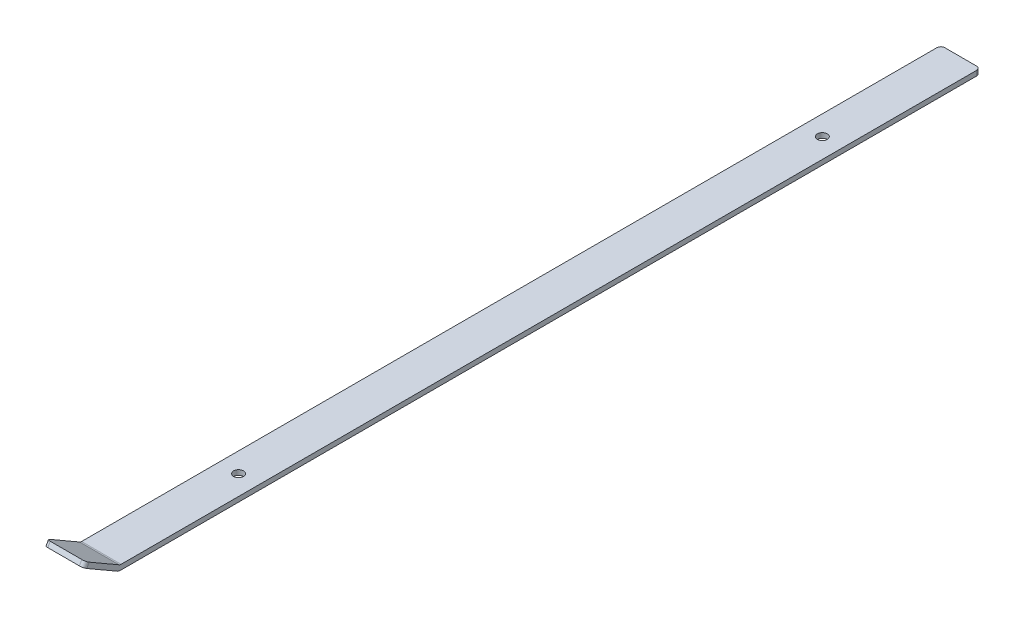
ISO-10303-21;
HEADER;
FILE_DESCRIPTION(('STEP AP214'),'2;1');
FILE_NAME('part.step','',(''),(''),'','','');
FILE_SCHEMA(('AUTOMOTIVE_DESIGN { 1 0 10303 214 1 1 1 1 }'));
ENDSEC;
DATA;
#1=APPLICATION_CONTEXT('core data for automotive mechanical design processes');
#2=APPLICATION_PROTOCOL_DEFINITION('international standard','automotive_design',2000,#1);
#3=PRODUCT_CONTEXT('',#1,'mechanical');
#4=PRODUCT('Part','Part','',(#3));
#5=PRODUCT_RELATED_PRODUCT_CATEGORY('part','',(#4));
#6=PRODUCT_DEFINITION_FORMATION('','',#4);
#7=PRODUCT_DEFINITION_CONTEXT('part definition',#1,'design');
#8=PRODUCT_DEFINITION('design','',#6,#7);
#9=PRODUCT_DEFINITION_SHAPE('','',#8);
#10=(LENGTH_UNIT() NAMED_UNIT(*) SI_UNIT(.MILLI.,.METRE.));
#11=(NAMED_UNIT(*) PLANE_ANGLE_UNIT() SI_UNIT($,.RADIAN.));
#12=(NAMED_UNIT(*) SI_UNIT($,.STERADIAN.) SOLID_ANGLE_UNIT());
#13=UNCERTAINTY_MEASURE_WITH_UNIT(LENGTH_MEASURE(1.E-05),#10,'distance_accuracy_value','');
#14=(GEOMETRIC_REPRESENTATION_CONTEXT(3) GLOBAL_UNCERTAINTY_ASSIGNED_CONTEXT((#13)) GLOBAL_UNIT_ASSIGNED_CONTEXT((#10,
#11,#12)) REPRESENTATION_CONTEXT('',''));
#15=CARTESIAN_POINT('',(0.,0.,0.));
#16=DIRECTION('',(0.,0.,1.));
#17=DIRECTION('',(1.,0.,0.));
#18=AXIS2_PLACEMENT_3D('',#15,#16,#17);
#19=CARTESIAN_POINT('',(25.4,0.,0.));
#20=DIRECTION('',(0.,-1.,0.));
#21=DIRECTION('',(0.,0.,-1.));
#22=AXIS2_PLACEMENT_3D('',#19,#20,#21);
#23=PLANE('',#22);
#24=CARTESIAN_POINT('',(12.7,0.,-88.9));
#25=DIRECTION('',(0.,1.,0.));
#26=DIRECTION('',(0.,0.,1.));
#27=AXIS2_PLACEMENT_3D('',#24,#25,#26);
#28=CIRCLE('',#27,3.175);
#29=CARTESIAN_POINT('',(12.7,0.,-85.725));
#30=VERTEX_POINT('',#29);
#31=EDGE_CURVE('E281',#30,#30,#28,.T.);
#32=ORIENTED_EDGE('',*,*,#31,.F.);
#33=EDGE_LOOP('',(#32));
#34=FACE_BOUND('',#33,.T.);
#35=CARTESIAN_POINT('',(12.7,0.,-464.2612));
#36=DIRECTION('',(0.,1.,0.));
#37=DIRECTION('',(0.,0.,1.));
#38=AXIS2_PLACEMENT_3D('',#35,#36,#37);
#39=CIRCLE('',#38,3.175);
#40=CARTESIAN_POINT('',(12.7,0.,-461.0862));
#41=VERTEX_POINT('',#40);
#42=EDGE_CURVE('E273',#41,#41,#39,.T.);
#43=ORIENTED_EDGE('',*,*,#42,.F.);
#44=EDGE_LOOP('',(#43));
#45=FACE_BOUND('',#44,.T.);
#46=DIRECTION('',(-1.,0.,0.));
#47=VECTOR('',#46,1.);
#48=CARTESIAN_POINT('',(25.4,0.,-553.1612));
#49=LINE('',#48,#47);
#50=CARTESIAN_POINT('',(22.86,0.,-553.1612));
#51=VERTEX_POINT('',#50);
#52=CARTESIAN_POINT('',(2.54,0.,-553.1612));
#53=VERTEX_POINT('',#52);
#54=EDGE_CURVE('E163',#51,#53,#49,.T.);
#55=ORIENTED_EDGE('',*,*,#54,.T.);
#56=CARTESIAN_POINT('',(2.54,0.,-550.6212));
#57=DIRECTION('',(0.,-1.,0.));
#58=DIRECTION('',(0.,0.,-1.));
#59=AXIS2_PLACEMENT_3D('',#56,#57,#58);
#60=CIRCLE('',#59,2.54);
#61=CARTESIAN_POINT('',(0.,0.,-550.6212));
#62=VERTEX_POINT('',#61);
#63=EDGE_CURVE('E212',#53,#62,#60,.F.);
#64=ORIENTED_EDGE('',*,*,#63,.T.);
#65=DIRECTION('',(0.,0.,1.));
#66=VECTOR('',#65,1.);
#67=CARTESIAN_POINT('',(0.,0.,0.));
#68=LINE('',#67,#66);
#69=CARTESIAN_POINT('',(0.,0.,-0.680590948775043));
#70=VERTEX_POINT('',#69);
#71=EDGE_CURVE('E167',#62,#70,#68,.T.);
#72=ORIENTED_EDGE('',*,*,#71,.T.);
#73=DIRECTION('',(-1.,0.,0.));
#74=VECTOR('',#73,1.);
#75=CARTESIAN_POINT('',(25.4,0.,-0.680590948775043));
#76=LINE('',#75,#74);
#77=CARTESIAN_POINT('',(25.4,0.,-0.680590948775043));
#78=VERTEX_POINT('',#77);
#79=EDGE_CURVE('E206',#70,#78,#76,.F.);
#80=ORIENTED_EDGE('',*,*,#79,.T.);
#81=DIRECTION('',(0.,0.,1.));
#82=VECTOR('',#81,1.);
#83=CARTESIAN_POINT('',(25.4,0.,0.));
#84=LINE('',#83,#82);
#85=CARTESIAN_POINT('',(25.4,0.,-550.6212));
#86=VERTEX_POINT('',#85);
#87=EDGE_CURVE('E184',#86,#78,#84,.T.);
#88=ORIENTED_EDGE('',*,*,#87,.F.);
#89=CARTESIAN_POINT('',(22.86,0.,-550.6212));
#90=DIRECTION('',(0.,-1.,0.));
#91=DIRECTION('',(0.,0.,-1.));
#92=AXIS2_PLACEMENT_3D('',#89,#90,#91);
#93=CIRCLE('',#92,2.54);
#94=EDGE_CURVE('E209',#86,#51,#93,.F.);
#95=ORIENTED_EDGE('',*,*,#94,.T.);
#96=EDGE_LOOP('',(#55,#64,#72,#80,#88,#95));
#97=FACE_BOUND('',#96,.T.);
#98=ADVANCED_FACE('F39',(#34,#45,#97),#23,.F.);
#99=CARTESIAN_POINT('',(25.4,0.,0.));
#100=DIRECTION('',(0.,-0.866025403784442,0.499999999999995));
#101=DIRECTION('',(0.,-0.499999999999995,-0.866025403784442));
#102=AXIS2_PLACEMENT_3D('',#99,#100,#101);
#103=PLANE('',#102);
#104=DIRECTION('',(0.,0.499999999999995,0.866025403784442));
#105=VECTOR('',#104,1.);
#106=CARTESIAN_POINT('',(0.,0.,0.));
#107=LINE('',#106,#105);
#108=CARTESIAN_POINT('',(0.,0.340295474387518,0.589409051224943));
#109=VERTEX_POINT('',#108);
#110=CARTESIAN_POINT('',(0.,11.4299999999999,19.7973407305123));
#111=VERTEX_POINT('',#110);
#112=EDGE_CURVE('E171',#109,#111,#107,.T.);
#113=ORIENTED_EDGE('',*,*,#112,.T.);
#114=CARTESIAN_POINT('',(2.54,11.4299999999999,19.7973407305123));
#115=DIRECTION('',(0.,-0.866025403784442,0.499999999999995));
#116=DIRECTION('',(0.,-0.499999999999995,-0.866025403784442));
#117=AXIS2_PLACEMENT_3D('',#114,#115,#116);
#118=CIRCLE('',#117,2.54);
#119=CARTESIAN_POINT('',(2.54,12.6999999999999,21.9970452561248));
#120=VERTEX_POINT('',#119);
#121=EDGE_CURVE('E55',#111,#120,#118,.F.);
#122=ORIENTED_EDGE('',*,*,#121,.T.);
#123=DIRECTION('',(-1.,0.,0.));
#124=VECTOR('',#123,1.);
#125=CARTESIAN_POINT('',(25.4,12.6999999999999,21.9970452561248));
#126=LINE('',#125,#124);
#127=CARTESIAN_POINT('',(22.86,12.6999999999999,21.9970452561248));
#128=VERTEX_POINT('',#127);
#129=EDGE_CURVE('E196',#128,#120,#126,.T.);
#130=ORIENTED_EDGE('',*,*,#129,.F.);
#131=CARTESIAN_POINT('',(22.86,11.4299999999999,19.7973407305123));
#132=DIRECTION('',(0.,-0.866025403784442,0.499999999999995));
#133=DIRECTION('',(0.,-0.499999999999995,-0.866025403784442));
#134=AXIS2_PLACEMENT_3D('',#131,#132,#133);
#135=CIRCLE('',#134,2.54);
#136=CARTESIAN_POINT('',(25.4,11.4299999999999,19.7973407305123));
#137=VERTEX_POINT('',#136);
#138=EDGE_CURVE('E249',#128,#137,#135,.F.);
#139=ORIENTED_EDGE('',*,*,#138,.T.);
#140=DIRECTION('',(0.,0.499999999999995,0.866025403784442));
#141=VECTOR('',#140,1.);
#142=CARTESIAN_POINT('',(25.4,0.,0.));
#143=LINE('',#142,#141);
#144=CARTESIAN_POINT('',(25.4,0.340295474387518,0.589409051224943));
#145=VERTEX_POINT('',#144);
#146=EDGE_CURVE('E142',#145,#137,#143,.T.);
#147=ORIENTED_EDGE('',*,*,#146,.F.);
#148=DIRECTION('',(-1.,0.,0.));
#149=VECTOR('',#148,1.);
#150=CARTESIAN_POINT('',(0.,0.340295474387518,0.589409051224943));
#151=LINE('',#150,#149);
#152=EDGE_CURVE('E245',#145,#109,#151,.T.);
#153=ORIENTED_EDGE('',*,*,#152,.T.);
#154=EDGE_LOOP('',(#113,#122,#130,#139,#147,#153));
#155=FACE_BOUND('',#154,.T.);
#156=ADVANCED_FACE('F267',(#155),#103,.F.);
#157=CARTESIAN_POINT('',(25.4,12.6999999999999,21.9970452561248));
#158=DIRECTION('',(0.,-0.499999999999992,-0.866025403784443));
#159=DIRECTION('',(0.,0.866025403784443,-0.499999999999992));
#160=AXIS2_PLACEMENT_3D('',#157,#158,#159);
#161=PLANE('',#160);
#162=ORIENTED_EDGE('',*,*,#129,.T.);
#163=DIRECTION('',(0.,-0.866025403784443,0.499999999999992));
#164=VECTOR('',#163,1.);
#165=CARTESIAN_POINT('',(2.54,9.95036934298425,23.5845452561248));
#166=LINE('',#165,#164);
#167=CARTESIAN_POINT('',(2.54,9.95036934298425,23.5845452561248));
#168=VERTEX_POINT('',#167);
#169=EDGE_CURVE('E235',#120,#168,#166,.T.);
#170=ORIENTED_EDGE('',*,*,#169,.T.);
#171=DIRECTION('',(-1.,0.,0.));
#172=VECTOR('',#171,1.);
#173=CARTESIAN_POINT('',(25.4,9.95036934298425,23.5845452561248));
#174=LINE('',#173,#172);
#175=CARTESIAN_POINT('',(22.86,9.95036934298425,23.5845452561248));
#176=VERTEX_POINT('',#175);
#177=EDGE_CURVE('E153',#176,#168,#174,.T.);
#178=ORIENTED_EDGE('',*,*,#177,.F.);
#179=DIRECTION('',(0.,-0.866025403784443,0.499999999999992));
#180=VECTOR('',#179,1.);
#181=CARTESIAN_POINT('',(22.86,12.6999999999999,21.9970452561248));
#182=LINE('',#181,#180);
#183=EDGE_CURVE('E62',#176,#128,#182,.F.);
#184=ORIENTED_EDGE('',*,*,#183,.T.);
#185=EDGE_LOOP('',(#162,#170,#178,#184));
#186=FACE_BOUND('',#185,.T.);
#187=ADVANCED_FACE('F326',(#186),#161,.F.);
#188=CARTESIAN_POINT('',(25.4,9.95036934298425,23.5845452561248));
#189=DIRECTION('',(0.,0.866025403784442,-0.499999999999994));
#190=DIRECTION('',(0.,0.499999999999995,0.866025403784442));
#191=AXIS2_PLACEMENT_3D('',#188,#189,#190);
#192=PLANE('',#191);
#193=ORIENTED_EDGE('',*,*,#177,.T.);
#194=CARTESIAN_POINT('',(2.54,8.68036934298426,21.3848407305123));
#195=DIRECTION('',(0.,0.866025403784442,-0.499999999999994));
#196=DIRECTION('',(0.,0.499999999999995,0.866025403784442));
#197=AXIS2_PLACEMENT_3D('',#194,#195,#196);
#198=CIRCLE('',#197,2.54);
#199=CARTESIAN_POINT('',(0.,8.68036934298426,21.3848407305123));
#200=VERTEX_POINT('',#199);
#201=EDGE_CURVE('E242',#168,#200,#198,.F.);
#202=ORIENTED_EDGE('',*,*,#201,.T.);
#203=DIRECTION('',(0.,-0.499999999999994,-0.866025403784442));
#204=VECTOR('',#203,1.);
#205=CARTESIAN_POINT('',(0.,9.95036934298425,23.5845452561248));
#206=LINE('',#205,#204);
#207=CARTESIAN_POINT('',(0.,-2.7496306570156,1.58749999999998));
#208=VERTEX_POINT('',#207);
#209=EDGE_CURVE('E149',#200,#208,#206,.T.);
#210=ORIENTED_EDGE('',*,*,#209,.T.);
#211=DIRECTION('',(-1.,0.,0.));
#212=VECTOR('',#211,1.);
#213=CARTESIAN_POINT('',(25.4,-2.7496306570156,1.58749999999998));
#214=LINE('',#213,#212);
#215=CARTESIAN_POINT('',(25.4,-2.7496306570156,1.58749999999998));
#216=VERTEX_POINT('',#215);
#217=EDGE_CURVE('E145',#216,#208,#214,.T.);
#218=ORIENTED_EDGE('',*,*,#217,.F.);
#219=DIRECTION('',(0.,-0.499999999999994,-0.866025403784442));
#220=VECTOR('',#219,1.);
#221=CARTESIAN_POINT('',(25.4,9.95036934298425,23.5845452561248));
#222=LINE('',#221,#220);
#223=CARTESIAN_POINT('',(25.4,8.68036934298426,21.3848407305123));
#224=VERTEX_POINT('',#223);
#225=EDGE_CURVE('E130',#224,#216,#222,.T.);
#226=ORIENTED_EDGE('',*,*,#225,.F.);
#227=CARTESIAN_POINT('',(22.86,8.68036934298426,21.3848407305123));
#228=DIRECTION('',(0.,0.866025403784442,-0.499999999999994));
#229=DIRECTION('',(0.,0.499999999999995,0.866025403784442));
#230=AXIS2_PLACEMENT_3D('',#227,#228,#229);
#231=CIRCLE('',#230,2.54);
#232=EDGE_CURVE('E239',#224,#176,#231,.F.);
#233=ORIENTED_EDGE('',*,*,#232,.T.);
#234=EDGE_LOOP('',(#193,#202,#210,#218,#226,#233));
#235=FACE_BOUND('',#234,.T.);
#236=ADVANCED_FACE('F147',(#235),#192,.F.);
#237=CARTESIAN_POINT('',(25.4,0.,0.));
#238=DIRECTION('',(-1.,0.,0.));
#239=DIRECTION('',(0.,0.,1.));
#240=AXIS2_PLACEMENT_3D('',#237,#238,#239);
#241=CYLINDRICAL_SURFACE('',#240,3.175);
#242=CARTESIAN_POINT('',(0.,0.,0.));
#243=DIRECTION('',(1.,0.,0.));
#244=DIRECTION('',(0.,0.,1.));
#245=AXIS2_PLACEMENT_3D('',#242,#243,#244);
#246=CIRCLE('',#245,3.175);
#247=CARTESIAN_POINT('',(0.,-3.175,0.));
#248=VERTEX_POINT('',#247);
#249=EDGE_CURVE('E177',#208,#248,#246,.T.);
#250=ORIENTED_EDGE('',*,*,#249,.T.);
#251=DIRECTION('',(-1.,0.,0.));
#252=VECTOR('',#251,1.);
#253=CARTESIAN_POINT('',(25.4,-3.175,0.));
#254=LINE('',#253,#252);
#255=CARTESIAN_POINT('',(25.4,-3.175,0.));
#256=VERTEX_POINT('',#255);
#257=EDGE_CURVE('E154',#256,#248,#254,.T.);
#258=ORIENTED_EDGE('',*,*,#257,.F.);
#259=CARTESIAN_POINT('',(25.4,0.,0.));
#260=DIRECTION('',(1.,0.,0.));
#261=DIRECTION('',(0.,0.,1.));
#262=AXIS2_PLACEMENT_3D('',#259,#260,#261);
#263=CIRCLE('',#262,3.175);
#264=EDGE_CURVE('E135',#216,#256,#263,.T.);
#265=ORIENTED_EDGE('',*,*,#264,.F.);
#266=ORIENTED_EDGE('',*,*,#217,.T.);
#267=EDGE_LOOP('',(#250,#258,#265,#266));
#268=FACE_BOUND('',#267,.T.);
#269=ADVANCED_FACE('F156',(#268),#241,.T.);
#270=CARTESIAN_POINT('',(25.4,-3.175,0.));
#271=DIRECTION('',(0.,1.,0.));
#272=DIRECTION('',(0.,0.,1.));
#273=AXIS2_PLACEMENT_3D('',#270,#271,#272);
#274=PLANE('',#273);
#275=CARTESIAN_POINT('',(12.7,-3.175,-88.9));
#276=DIRECTION('',(0.,1.,0.));
#277=DIRECTION('',(0.,0.,1.));
#278=AXIS2_PLACEMENT_3D('',#275,#276,#277);
#279=CIRCLE('',#278,3.175);
#280=CARTESIAN_POINT('',(12.7,-3.175,-85.725));
#281=VERTEX_POINT('',#280);
#282=EDGE_CURVE('E172',#281,#281,#279,.T.);
#283=ORIENTED_EDGE('',*,*,#282,.T.);
#284=EDGE_LOOP('',(#283));
#285=FACE_BOUND('',#284,.T.);
#286=CARTESIAN_POINT('',(12.7,-3.175,-464.2612));
#287=DIRECTION('',(0.,1.,0.));
#288=DIRECTION('',(0.,0.,1.));
#289=AXIS2_PLACEMENT_3D('',#286,#287,#288);
#290=CIRCLE('',#289,3.175);
#291=CARTESIAN_POINT('',(12.7,-3.175,-461.0862));
#292=VERTEX_POINT('',#291);
#293=EDGE_CURVE('E277',#292,#292,#290,.T.);
#294=ORIENTED_EDGE('',*,*,#293,.T.);
#295=EDGE_LOOP('',(#294));
#296=FACE_BOUND('',#295,.T.);
#297=DIRECTION('',(0.,0.,-1.));
#298=VECTOR('',#297,1.);
#299=CARTESIAN_POINT('',(0.,-3.175,0.));
#300=LINE('',#299,#298);
#301=CARTESIAN_POINT('',(0.,-3.175,-550.6212));
#302=VERTEX_POINT('',#301);
#303=EDGE_CURVE('E180',#248,#302,#300,.T.);
#304=ORIENTED_EDGE('',*,*,#303,.T.);
#305=CARTESIAN_POINT('',(2.54,-3.175,-550.6212));
#306=DIRECTION('',(0.,1.,0.));
#307=DIRECTION('',(0.,0.,1.));
#308=AXIS2_PLACEMENT_3D('',#305,#306,#307);
#309=CIRCLE('',#308,2.54);
#310=CARTESIAN_POINT('',(2.54,-3.175,-553.1612));
#311=VERTEX_POINT('',#310);
#312=EDGE_CURVE('E224',#302,#311,#309,.F.);
#313=ORIENTED_EDGE('',*,*,#312,.T.);
#314=DIRECTION('',(-1.,0.,0.));
#315=VECTOR('',#314,1.);
#316=CARTESIAN_POINT('',(25.4,-3.175,-553.1612));
#317=LINE('',#316,#315);
#318=CARTESIAN_POINT('',(22.86,-3.175,-553.1612));
#319=VERTEX_POINT('',#318);
#320=EDGE_CURVE('E188',#319,#311,#317,.T.);
#321=ORIENTED_EDGE('',*,*,#320,.F.);
#322=CARTESIAN_POINT('',(22.86,-3.175,-550.6212));
#323=DIRECTION('',(0.,1.,0.));
#324=DIRECTION('',(0.,0.,1.));
#325=AXIS2_PLACEMENT_3D('',#322,#323,#324);
#326=CIRCLE('',#325,2.54);
#327=CARTESIAN_POINT('',(25.4,-3.175,-550.6212));
#328=VERTEX_POINT('',#327);
#329=EDGE_CURVE('E221',#319,#328,#326,.F.);
#330=ORIENTED_EDGE('',*,*,#329,.T.);
#331=DIRECTION('',(0.,0.,-1.));
#332=VECTOR('',#331,1.);
#333=CARTESIAN_POINT('',(25.4,-3.175,0.));
#334=LINE('',#333,#332);
#335=EDGE_CURVE('E160',#256,#328,#334,.T.);
#336=ORIENTED_EDGE('',*,*,#335,.F.);
#337=ORIENTED_EDGE('',*,*,#257,.T.);
#338=EDGE_LOOP('',(#304,#313,#321,#330,#336,#337));
#339=FACE_BOUND('',#338,.T.);
#340=ADVANCED_FACE('F289',(#285,#296,#339),#274,.F.);
#341=CARTESIAN_POINT('',(25.4,0.,-553.1612));
#342=DIRECTION('',(0.,0.,1.));
#343=DIRECTION('',(1.,0.,0.));
#344=AXIS2_PLACEMENT_3D('',#341,#342,#343);
#345=PLANE('',#344);
#346=ORIENTED_EDGE('',*,*,#320,.T.);
#347=DIRECTION('',(0.,1.,0.));
#348=VECTOR('',#347,1.);
#349=CARTESIAN_POINT('',(2.54,0.,-553.1612));
#350=LINE('',#349,#348);
#351=EDGE_CURVE('E202',#311,#53,#350,.T.);
#352=ORIENTED_EDGE('',*,*,#351,.T.);
#353=ORIENTED_EDGE('',*,*,#54,.F.);
#354=DIRECTION('',(0.,1.,0.));
#355=VECTOR('',#354,1.);
#356=CARTESIAN_POINT('',(22.86,0.,-553.1612));
#357=LINE('',#356,#355);
#358=EDGE_CURVE('E199',#51,#319,#357,.F.);
#359=ORIENTED_EDGE('',*,*,#358,.T.);
#360=EDGE_LOOP('',(#346,#352,#353,#359));
#361=FACE_BOUND('',#360,.T.);
#362=ADVANCED_FACE('F315',(#361),#345,.F.);
#363=CARTESIAN_POINT('',(25.4,0.,0.));
#364=DIRECTION('',(-1.,0.,0.));
#365=DIRECTION('',(0.,0.,1.));
#366=AXIS2_PLACEMENT_3D('',#363,#364,#365);
#367=PLANE('',#366);
#368=ORIENTED_EDGE('',*,*,#335,.T.);
#369=DIRECTION('',(0.,1.,0.));
#370=VECTOR('',#369,1.);
#371=CARTESIAN_POINT('',(25.4,0.,-550.6212));
#372=LINE('',#371,#370);
#373=EDGE_CURVE('E229',#328,#86,#372,.T.);
#374=ORIENTED_EDGE('',*,*,#373,.T.);
#375=ORIENTED_EDGE('',*,*,#87,.T.);
#376=CARTESIAN_POINT('',(25.4,2.54,-0.680590948775043));
#377=DIRECTION('',(-1.,0.,0.));
#378=DIRECTION('',(0.,0.,1.));
#379=AXIS2_PLACEMENT_3D('',#376,#377,#378);
#380=CIRCLE('',#379,2.54);
#381=EDGE_CURVE('E11',#78,#145,#380,.T.);
#382=ORIENTED_EDGE('',*,*,#381,.T.);
#383=ORIENTED_EDGE('',*,*,#146,.T.);
#384=DIRECTION('',(0.,-0.866025403784443,0.499999999999992));
#385=VECTOR('',#384,1.);
#386=CARTESIAN_POINT('',(25.4,11.4299999999998,19.7973407305124));
#387=LINE('',#386,#385);
#388=EDGE_CURVE('E139',#137,#224,#387,.T.);
#389=ORIENTED_EDGE('',*,*,#388,.T.);
#390=ORIENTED_EDGE('',*,*,#225,.T.);
#391=ORIENTED_EDGE('',*,*,#264,.T.);
#392=EDGE_LOOP('',(#368,#374,#375,#382,#383,#389,#390,#391));
#393=FACE_BOUND('',#392,.T.);
#394=ADVANCED_FACE('F133',(#393),#367,.F.);
#395=CARTESIAN_POINT('',(0.,0.,0.));
#396=DIRECTION('',(-1.,0.,0.));
#397=DIRECTION('',(0.,0.,1.));
#398=AXIS2_PLACEMENT_3D('',#395,#396,#397);
#399=PLANE('',#398);
#400=ORIENTED_EDGE('',*,*,#71,.F.);
#401=DIRECTION('',(0.,1.,0.));
#402=VECTOR('',#401,1.);
#403=CARTESIAN_POINT('',(0.,-3.175,-550.6212));
#404=LINE('',#403,#402);
#405=EDGE_CURVE('E218',#62,#302,#404,.F.);
#406=ORIENTED_EDGE('',*,*,#405,.T.);
#407=ORIENTED_EDGE('',*,*,#303,.F.);
#408=ORIENTED_EDGE('',*,*,#249,.F.);
#409=ORIENTED_EDGE('',*,*,#209,.F.);
#410=DIRECTION('',(0.,-0.866025403784443,0.499999999999992));
#411=VECTOR('',#410,1.);
#412=CARTESIAN_POINT('',(0.,11.4299999999999,19.7973407305123));
#413=LINE('',#412,#411);
#414=EDGE_CURVE('E215',#200,#111,#413,.F.);
#415=ORIENTED_EDGE('',*,*,#414,.T.);
#416=ORIENTED_EDGE('',*,*,#112,.F.);
#417=CARTESIAN_POINT('',(0.,2.54,-0.680590948775043));
#418=DIRECTION('',(-1.,0.,0.));
#419=DIRECTION('',(0.,0.,1.));
#420=AXIS2_PLACEMENT_3D('',#417,#418,#419);
#421=CIRCLE('',#420,2.54);
#422=EDGE_CURVE('E48',#109,#70,#421,.F.);
#423=ORIENTED_EDGE('',*,*,#422,.T.);
#424=EDGE_LOOP('',(#400,#406,#407,#408,#409,#415,#416,#423));
#425=FACE_BOUND('',#424,.T.);
#426=ADVANCED_FACE('F257',(#425),#399,.T.);
#427=CARTESIAN_POINT('',(12.7,-3.175,-464.2612));
#428=DIRECTION('',(0.,1.,0.));
#429=DIRECTION('',(0.,0.,1.));
#430=AXIS2_PLACEMENT_3D('',#427,#428,#429);
#431=CYLINDRICAL_SURFACE('',#430,3.175);
#432=ORIENTED_EDGE('',*,*,#293,.F.);
#433=EDGE_LOOP('',(#432));
#434=FACE_BOUND('',#433,.T.);
#435=ORIENTED_EDGE('',*,*,#42,.T.);
#436=EDGE_LOOP('',(#435));
#437=FACE_BOUND('',#436,.T.);
#438=ADVANCED_FACE('F296',(#434,#437),#431,.F.);
#439=CARTESIAN_POINT('',(12.7,-3.175,-88.9));
#440=DIRECTION('',(0.,1.,0.));
#441=DIRECTION('',(0.,0.,1.));
#442=AXIS2_PLACEMENT_3D('',#439,#440,#441);
#443=CYLINDRICAL_SURFACE('',#442,3.175);
#444=ORIENTED_EDGE('',*,*,#282,.F.);
#445=EDGE_LOOP('',(#444));
#446=FACE_BOUND('',#445,.T.);
#447=ORIENTED_EDGE('',*,*,#31,.T.);
#448=EDGE_LOOP('',(#447));
#449=FACE_BOUND('',#448,.T.);
#450=ADVANCED_FACE('F292',(#446,#449),#443,.F.);
#451=CARTESIAN_POINT('',(2.54,0.,-550.6212));
#452=DIRECTION('',(0.,-1.,0.));
#453=DIRECTION('',(0.,0.,-1.));
#454=AXIS2_PLACEMENT_3D('',#451,#452,#453);
#455=CYLINDRICAL_SURFACE('',#454,2.54);
#456=ORIENTED_EDGE('',*,*,#312,.F.);
#457=ORIENTED_EDGE('',*,*,#405,.F.);
#458=ORIENTED_EDGE('',*,*,#63,.F.);
#459=ORIENTED_EDGE('',*,*,#351,.F.);
#460=EDGE_LOOP('',(#456,#457,#458,#459));
#461=FACE_BOUND('',#460,.T.);
#462=ADVANCED_FACE('F295',(#461),#455,.T.);
#463=CARTESIAN_POINT('',(22.86,0.,-550.6212));
#464=DIRECTION('',(0.,1.,0.));
#465=DIRECTION('',(0.,0.,1.));
#466=AXIS2_PLACEMENT_3D('',#463,#464,#465);
#467=CYLINDRICAL_SURFACE('',#466,2.54);
#468=ORIENTED_EDGE('',*,*,#329,.F.);
#469=ORIENTED_EDGE('',*,*,#358,.F.);
#470=ORIENTED_EDGE('',*,*,#94,.F.);
#471=ORIENTED_EDGE('',*,*,#373,.F.);
#472=EDGE_LOOP('',(#468,#469,#470,#471));
#473=FACE_BOUND('',#472,.T.);
#474=ADVANCED_FACE('F333',(#473),#467,.T.);
#475=CARTESIAN_POINT('',(2.54,11.4299999999999,19.7973407305123));
#476=DIRECTION('',(0.,0.866025403784443,-0.499999999999992));
#477=DIRECTION('',(0.,0.499999999999992,0.866025403784443));
#478=AXIS2_PLACEMENT_3D('',#475,#476,#477);
#479=CYLINDRICAL_SURFACE('',#478,2.54);
#480=ORIENTED_EDGE('',*,*,#121,.F.);
#481=ORIENTED_EDGE('',*,*,#414,.F.);
#482=ORIENTED_EDGE('',*,*,#201,.F.);
#483=ORIENTED_EDGE('',*,*,#169,.F.);
#484=EDGE_LOOP('',(#480,#481,#482,#483));
#485=FACE_BOUND('',#484,.T.);
#486=ADVANCED_FACE('F337',(#485),#479,.T.);
#487=CARTESIAN_POINT('',(22.86,11.4299999999998,19.7973407305124));
#488=DIRECTION('',(0.,-0.866025403784443,0.499999999999992));
#489=DIRECTION('',(0.,-0.499999999999992,-0.866025403784443));
#490=AXIS2_PLACEMENT_3D('',#487,#488,#489);
#491=CYLINDRICAL_SURFACE('',#490,2.54);
#492=ORIENTED_EDGE('',*,*,#138,.F.);
#493=ORIENTED_EDGE('',*,*,#183,.F.);
#494=ORIENTED_EDGE('',*,*,#232,.F.);
#495=ORIENTED_EDGE('',*,*,#388,.F.);
#496=EDGE_LOOP('',(#492,#493,#494,#495));
#497=FACE_BOUND('',#496,.T.);
#498=ADVANCED_FACE('F340',(#497),#491,.T.);
#499=CARTESIAN_POINT('',(25.4,2.54,-0.680590948775043));
#500=DIRECTION('',(1.,0.,0.));
#501=DIRECTION('',(0.,0.,-1.));
#502=AXIS2_PLACEMENT_3D('',#499,#500,#501);
#503=CYLINDRICAL_SURFACE('',#502,2.54);
#504=ORIENTED_EDGE('',*,*,#381,.F.);
#505=ORIENTED_EDGE('',*,*,#79,.F.);
#506=ORIENTED_EDGE('',*,*,#422,.F.);
#507=ORIENTED_EDGE('',*,*,#152,.F.);
#508=EDGE_LOOP('',(#504,#505,#506,#507));
#509=FACE_BOUND('',#508,.T.);
#510=ADVANCED_FACE('F41',(#509),#503,.F.);
#511=CLOSED_SHELL('',(#98,#156,#187,#236,#269,#340,#362,#394,#426,#438,#450,#462,#474,#486,#498,#510));
#512=MANIFOLD_SOLID_BREP('B2',#511);
#513=ADVANCED_BREP_SHAPE_REPRESENTATION('',(#18,#512),#14);
#514=SHAPE_DEFINITION_REPRESENTATION(#9,#513);
ENDSEC;
END-ISO-10303-21;
